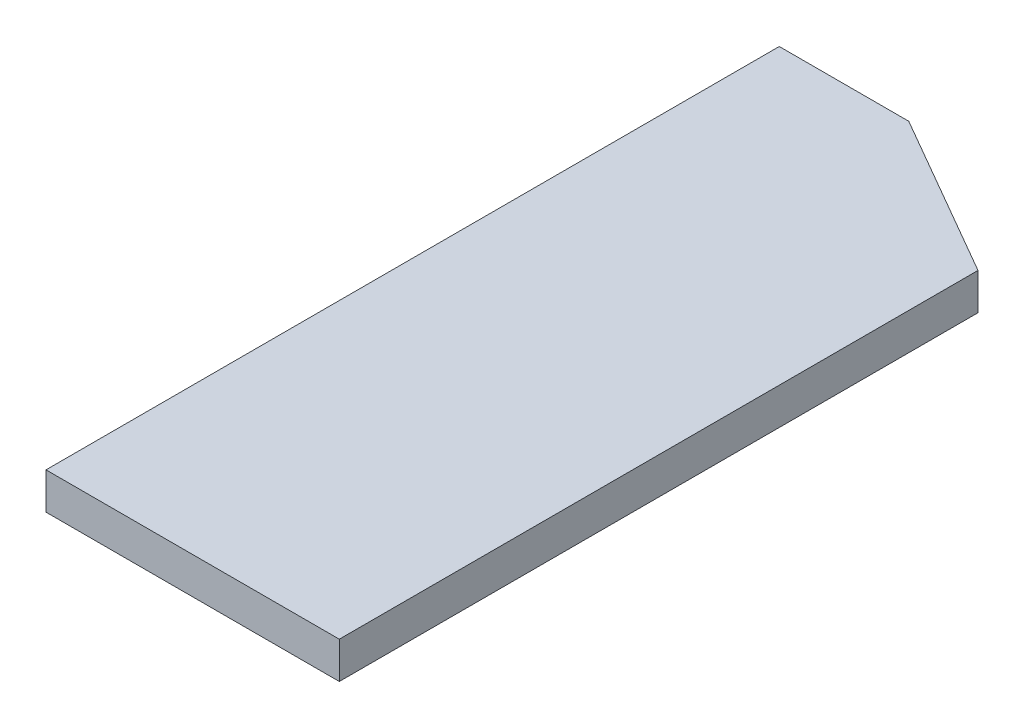
ISO-10303-21;
HEADER;
FILE_DESCRIPTION(('STEP AP214'),'2;1');
FILE_NAME('part.step','',(''),(''),'','','');
FILE_SCHEMA(('AUTOMOTIVE_DESIGN { 1 0 10303 214 1 1 1 1 }'));
ENDSEC;
DATA;
#1=APPLICATION_CONTEXT('core data for automotive mechanical design processes');
#2=APPLICATION_PROTOCOL_DEFINITION('international standard','automotive_design',2000,#1);
#3=PRODUCT_CONTEXT('',#1,'mechanical');
#4=PRODUCT('Part','Part','',(#3));
#5=PRODUCT_RELATED_PRODUCT_CATEGORY('part','',(#4));
#6=PRODUCT_DEFINITION_FORMATION('','',#4);
#7=PRODUCT_DEFINITION_CONTEXT('part definition',#1,'design');
#8=PRODUCT_DEFINITION('design','',#6,#7);
#9=PRODUCT_DEFINITION_SHAPE('','',#8);
#10=(LENGTH_UNIT() NAMED_UNIT(*) SI_UNIT(.MILLI.,.METRE.));
#11=(NAMED_UNIT(*) PLANE_ANGLE_UNIT() SI_UNIT($,.RADIAN.));
#12=(NAMED_UNIT(*) SI_UNIT($,.STERADIAN.) SOLID_ANGLE_UNIT());
#13=UNCERTAINTY_MEASURE_WITH_UNIT(LENGTH_MEASURE(1.E-05),#10,'distance_accuracy_value','');
#14=(GEOMETRIC_REPRESENTATION_CONTEXT(3) GLOBAL_UNCERTAINTY_ASSIGNED_CONTEXT((#13)) GLOBAL_UNIT_ASSIGNED_CONTEXT((#10,
#11,#12)) REPRESENTATION_CONTEXT('',''));
#15=CARTESIAN_POINT('',(0.,0.,0.));
#16=DIRECTION('',(0.,0.,1.));
#17=DIRECTION('',(1.,0.,0.));
#18=AXIS2_PLACEMENT_3D('',#15,#16,#17);
#19=CARTESIAN_POINT('',(0.,5.,0.));
#20=DIRECTION('',(1.,0.,0.));
#21=DIRECTION('',(0.,0.,-1.));
#22=AXIS2_PLACEMENT_3D('',#19,#20,#21);
#23=PLANE('',#22);
#24=DIRECTION('',(0.,0.,1.));
#25=VECTOR('',#24,1.);
#26=CARTESIAN_POINT('',(0.,0.,0.));
#27=LINE('',#26,#25);
#28=CARTESIAN_POINT('',(0.,0.,-100.));
#29=VERTEX_POINT('',#28);
#30=CARTESIAN_POINT('',(0.,0.,0.));
#31=VERTEX_POINT('',#30);
#32=EDGE_CURVE('E109',#29,#31,#27,.T.);
#33=ORIENTED_EDGE('',*,*,#32,.T.);
#34=DIRECTION('',(0.,-1.,0.));
#35=VECTOR('',#34,1.);
#36=CARTESIAN_POINT('',(0.,5.,0.));
#37=LINE('',#36,#35);
#38=CARTESIAN_POINT('',(0.,5.,0.));
#39=VERTEX_POINT('',#38);
#40=EDGE_CURVE('E11',#39,#31,#37,.T.);
#41=ORIENTED_EDGE('',*,*,#40,.F.);
#42=DIRECTION('',(0.,0.,1.));
#43=VECTOR('',#42,1.);
#44=CARTESIAN_POINT('',(0.,5.,0.));
#45=LINE('',#44,#43);
#46=CARTESIAN_POINT('',(0.,5.,-100.));
#47=VERTEX_POINT('',#46);
#48=EDGE_CURVE('E117',#47,#39,#45,.T.);
#49=ORIENTED_EDGE('',*,*,#48,.F.);
#50=DIRECTION('',(0.,-1.,0.));
#51=VECTOR('',#50,1.);
#52=CARTESIAN_POINT('',(0.,5.,-100.));
#53=LINE('',#52,#51);
#54=EDGE_CURVE('E105',#47,#29,#53,.T.);
#55=ORIENTED_EDGE('',*,*,#54,.T.);
#56=EDGE_LOOP('',(#33,#41,#49,#55));
#57=FACE_BOUND('',#56,.T.);
#58=ADVANCED_FACE('F35',(#57),#23,.F.);
#59=CARTESIAN_POINT('',(0.,5.,0.));
#60=DIRECTION('',(0.,0.,-1.));
#61=DIRECTION('',(-1.,0.,0.));
#62=AXIS2_PLACEMENT_3D('',#59,#60,#61);
#63=PLANE('',#62);
#64=DIRECTION('',(1.,0.,0.));
#65=VECTOR('',#64,1.);
#66=CARTESIAN_POINT('',(0.,0.,0.));
#67=LINE('',#66,#65);
#68=CARTESIAN_POINT('',(40.,0.,0.));
#69=VERTEX_POINT('',#68);
#70=EDGE_CURVE('E112',#31,#69,#67,.T.);
#71=ORIENTED_EDGE('',*,*,#70,.T.);
#72=DIRECTION('',(0.,-1.,0.));
#73=VECTOR('',#72,1.);
#74=CARTESIAN_POINT('',(40.,5.,0.));
#75=LINE('',#74,#73);
#76=CARTESIAN_POINT('',(40.,5.,0.));
#77=VERTEX_POINT('',#76);
#78=EDGE_CURVE('E43',#77,#69,#75,.T.);
#79=ORIENTED_EDGE('',*,*,#78,.F.);
#80=DIRECTION('',(1.,0.,0.));
#81=VECTOR('',#80,1.);
#82=CARTESIAN_POINT('',(0.,5.,0.));
#83=LINE('',#82,#81);
#84=EDGE_CURVE('E85',#39,#77,#83,.T.);
#85=ORIENTED_EDGE('',*,*,#84,.F.);
#86=ORIENTED_EDGE('',*,*,#40,.T.);
#87=EDGE_LOOP('',(#71,#79,#85,#86));
#88=FACE_BOUND('',#87,.T.);
#89=ADVANCED_FACE('F136',(#88),#63,.F.);
#90=CARTESIAN_POINT('',(40.,5.,0.));
#91=DIRECTION('',(-1.,0.,0.));
#92=DIRECTION('',(0.,0.,1.));
#93=AXIS2_PLACEMENT_3D('',#90,#91,#92);
#94=PLANE('',#93);
#95=DIRECTION('',(0.,0.,-1.));
#96=VECTOR('',#95,1.);
#97=CARTESIAN_POINT('',(40.,0.,0.));
#98=LINE('',#97,#96);
#99=CARTESIAN_POINT('',(40.,0.,-87.102642410038));
#100=VERTEX_POINT('',#99);
#101=EDGE_CURVE('E100',#69,#100,#98,.T.);
#102=ORIENTED_EDGE('',*,*,#101,.T.);
#103=DIRECTION('',(0.,-1.,0.));
#104=VECTOR('',#103,1.);
#105=CARTESIAN_POINT('',(40.,5.,-87.102642410038));
#106=LINE('',#105,#104);
#107=CARTESIAN_POINT('',(40.,5.,-87.102642410038));
#108=VERTEX_POINT('',#107);
#109=EDGE_CURVE('E97',#108,#100,#106,.T.);
#110=ORIENTED_EDGE('',*,*,#109,.F.);
#111=DIRECTION('',(0.,0.,-1.));
#112=VECTOR('',#111,1.);
#113=CARTESIAN_POINT('',(40.,5.,0.));
#114=LINE('',#113,#112);
#115=EDGE_CURVE('E89',#77,#108,#114,.T.);
#116=ORIENTED_EDGE('',*,*,#115,.F.);
#117=ORIENTED_EDGE('',*,*,#78,.T.);
#118=EDGE_LOOP('',(#102,#110,#116,#117));
#119=FACE_BOUND('',#118,.T.);
#120=ADVANCED_FACE('F98',(#119),#94,.F.);
#121=CARTESIAN_POINT('',(17.6611213708019,5.,-100.));
#122=DIRECTION('',(-0.500000000000001,0.,0.866025403784438));
#123=DIRECTION('',(0.866025403784438,0.,0.500000000000001));
#124=AXIS2_PLACEMENT_3D('',#121,#122,#123);
#125=PLANE('',#124);
#126=DIRECTION('',(-0.866025403784438,0.,-0.500000000000001));
#127=VECTOR('',#126,1.);
#128=CARTESIAN_POINT('',(17.6611213708019,0.,-100.));
#129=LINE('',#128,#127);
#130=CARTESIAN_POINT('',(17.6611213708019,0.,-100.));
#131=VERTEX_POINT('',#130);
#132=EDGE_CURVE('E71',#100,#131,#129,.T.);
#133=ORIENTED_EDGE('',*,*,#132,.T.);
#134=DIRECTION('',(0.,-1.,0.));
#135=VECTOR('',#134,1.);
#136=CARTESIAN_POINT('',(17.6611213708019,5.,-100.));
#137=LINE('',#136,#135);
#138=CARTESIAN_POINT('',(17.6611213708019,5.,-100.));
#139=VERTEX_POINT('',#138);
#140=EDGE_CURVE('E101',#139,#131,#137,.T.);
#141=ORIENTED_EDGE('',*,*,#140,.F.);
#142=DIRECTION('',(-0.866025403784438,0.,-0.500000000000001));
#143=VECTOR('',#142,1.);
#144=CARTESIAN_POINT('',(17.6611213708019,5.,-100.));
#145=LINE('',#144,#143);
#146=EDGE_CURVE('E93',#108,#139,#145,.T.);
#147=ORIENTED_EDGE('',*,*,#146,.F.);
#148=ORIENTED_EDGE('',*,*,#109,.T.);
#149=EDGE_LOOP('',(#133,#141,#147,#148));
#150=FACE_BOUND('',#149,.T.);
#151=ADVANCED_FACE('F103',(#150),#125,.F.);
#152=CARTESIAN_POINT('',(0.,5.,-100.));
#153=DIRECTION('',(0.,0.,1.));
#154=DIRECTION('',(1.,0.,0.));
#155=AXIS2_PLACEMENT_3D('',#152,#153,#154);
#156=PLANE('',#155);
#157=DIRECTION('',(-1.,0.,0.));
#158=VECTOR('',#157,1.);
#159=CARTESIAN_POINT('',(0.,0.,-100.));
#160=LINE('',#159,#158);
#161=EDGE_CURVE('E77',#131,#29,#160,.T.);
#162=ORIENTED_EDGE('',*,*,#161,.T.);
#163=ORIENTED_EDGE('',*,*,#54,.F.);
#164=DIRECTION('',(-1.,0.,0.));
#165=VECTOR('',#164,1.);
#166=CARTESIAN_POINT('',(0.,5.,-100.));
#167=LINE('',#166,#165);
#168=EDGE_CURVE('E51',#139,#47,#167,.T.);
#169=ORIENTED_EDGE('',*,*,#168,.F.);
#170=ORIENTED_EDGE('',*,*,#140,.T.);
#171=EDGE_LOOP('',(#162,#163,#169,#170));
#172=FACE_BOUND('',#171,.T.);
#173=ADVANCED_FACE('F125',(#172),#156,.F.);
#174=CARTESIAN_POINT('',(0.,5.,0.));
#175=DIRECTION('',(0.,-1.,0.));
#176=DIRECTION('',(0.,0.,-1.));
#177=AXIS2_PLACEMENT_3D('',#174,#175,#176);
#178=PLANE('',#177);
#179=ORIENTED_EDGE('',*,*,#48,.T.);
#180=ORIENTED_EDGE('',*,*,#84,.T.);
#181=ORIENTED_EDGE('',*,*,#115,.T.);
#182=ORIENTED_EDGE('',*,*,#146,.T.);
#183=ORIENTED_EDGE('',*,*,#168,.T.);
#184=EDGE_LOOP('',(#179,#180,#181,#182,#183));
#185=FACE_BOUND('',#184,.T.);
#186=ADVANCED_FACE('F91',(#185),#178,.F.);
#187=CARTESIAN_POINT('',(0.,0.,0.));
#188=DIRECTION('',(0.,-1.,0.));
#189=DIRECTION('',(0.,0.,-1.));
#190=AXIS2_PLACEMENT_3D('',#187,#188,#189);
#191=PLANE('',#190);
#192=ORIENTED_EDGE('',*,*,#32,.F.);
#193=ORIENTED_EDGE('',*,*,#161,.F.);
#194=ORIENTED_EDGE('',*,*,#132,.F.);
#195=ORIENTED_EDGE('',*,*,#101,.F.);
#196=ORIENTED_EDGE('',*,*,#70,.F.);
#197=EDGE_LOOP('',(#192,#193,#194,#195,#196));
#198=FACE_BOUND('',#197,.T.);
#199=ADVANCED_FACE('F121',(#198),#191,.T.);
#200=CLOSED_SHELL('',(#58,#89,#120,#151,#173,#186,#199));
#201=MANIFOLD_SOLID_BREP('B2',#200);
#202=ADVANCED_BREP_SHAPE_REPRESENTATION('',(#18,#201),#14);
#203=SHAPE_DEFINITION_REPRESENTATION(#9,#202);
ENDSEC;
END-ISO-10303-21;
